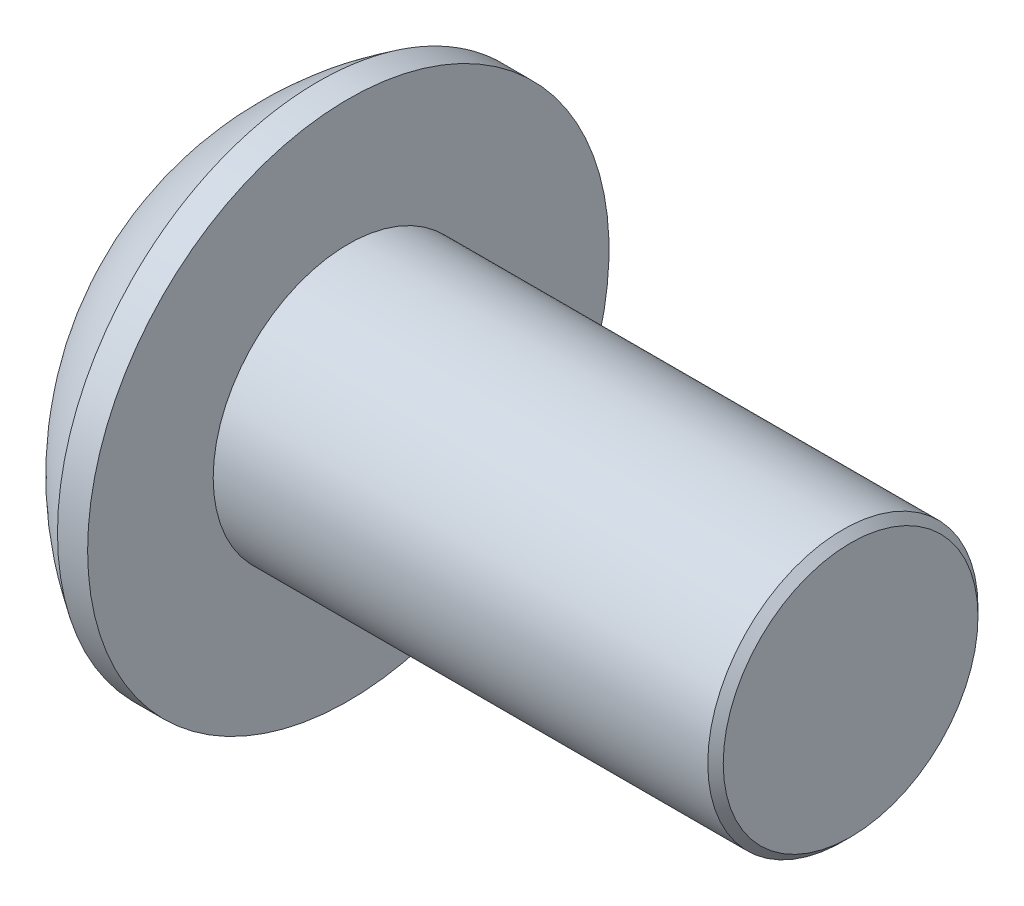
ISO-10303-21;
HEADER;
FILE_DESCRIPTION(('STEP AP214'),'2;1');
FILE_NAME('part.step','',(''),(''),'','','');
FILE_SCHEMA(('AUTOMOTIVE_DESIGN { 1 0 10303 214 1 1 1 1 }'));
ENDSEC;
DATA;
#1=APPLICATION_CONTEXT('core data for automotive mechanical design processes');
#2=APPLICATION_PROTOCOL_DEFINITION('international standard','automotive_design',2000,#1);
#3=PRODUCT_CONTEXT('',#1,'mechanical');
#4=PRODUCT('Part','Part','',(#3));
#5=PRODUCT_RELATED_PRODUCT_CATEGORY('part','',(#4));
#6=PRODUCT_DEFINITION_FORMATION('','',#4);
#7=PRODUCT_DEFINITION_CONTEXT('part definition',#1,'design');
#8=PRODUCT_DEFINITION('design','',#6,#7);
#9=PRODUCT_DEFINITION_SHAPE('','',#8);
#10=(LENGTH_UNIT() NAMED_UNIT(*) SI_UNIT(.MILLI.,.METRE.));
#11=(NAMED_UNIT(*) PLANE_ANGLE_UNIT() SI_UNIT($,.RADIAN.));
#12=(NAMED_UNIT(*) SI_UNIT($,.STERADIAN.) SOLID_ANGLE_UNIT());
#13=UNCERTAINTY_MEASURE_WITH_UNIT(LENGTH_MEASURE(1.E-05),#10,'distance_accuracy_value','');
#14=(GEOMETRIC_REPRESENTATION_CONTEXT(3) GLOBAL_UNCERTAINTY_ASSIGNED_CONTEXT((#13)) GLOBAL_UNIT_ASSIGNED_CONTEXT((#10,
#11,#12)) REPRESENTATION_CONTEXT('',''));
#15=CARTESIAN_POINT('',(0.,0.,0.));
#16=DIRECTION('',(0.,0.,1.));
#17=DIRECTION('',(1.,0.,0.));
#18=AXIS2_PLACEMENT_3D('',#15,#16,#17);
#19=CARTESIAN_POINT('',(1.32080000000034,0.,0.));
#20=DIRECTION('',(-1.,0.,0.));
#21=DIRECTION('',(0.,0.,1.));
#22=AXIS2_PLACEMENT_3D('',#19,#20,#21);
#23=CONICAL_SURFACE('',#22,1.1937999999998,1.04719755119608);
#24=CARTESIAN_POINT('',(2.01004075135902,0.,4.44089209850063E-13));
#25=VERTEX_POINT('',#24);
#26=VERTEX_LOOP('',#25);
#27=FACE_BOUND('',#26,.T.);
#28=CARTESIAN_POINT('',(1.32080000000009,0.,0.));
#29=DIRECTION('',(-1.,0.,0.));
#30=DIRECTION('',(0.,0.,1.));
#31=AXIS2_PLACEMENT_3D('',#28,#29,#30);
#32=CIRCLE('',#31,1.19380000000024);
#33=CARTESIAN_POINT('',(1.32080000000004,0.,1.19380000000012));
#34=VERTEX_POINT('',#33);
#35=CARTESIAN_POINT('',(1.32080000000004,-1.03386112703797,0.596900000000061));
#36=VERTEX_POINT('',#35);
#37=EDGE_CURVE('E20',#34,#36,#32,.F.);
#38=ORIENTED_EDGE('',*,*,#37,.F.);
#39=CARTESIAN_POINT('',(1.32080000000009,0.,0.));
#40=DIRECTION('',(-1.,0.,0.));
#41=DIRECTION('',(0.,0.,1.));
#42=AXIS2_PLACEMENT_3D('',#39,#40,#41);
#43=CIRCLE('',#42,1.19380000000024);
#44=CARTESIAN_POINT('',(1.32080000000004,1.03386112703797,0.596900000000063));
#45=VERTEX_POINT('',#44);
#46=EDGE_CURVE('E90',#45,#34,#43,.F.);
#47=ORIENTED_EDGE('',*,*,#46,.F.);
#48=CARTESIAN_POINT('',(1.32080000000009,0.,0.));
#49=DIRECTION('',(-1.,0.,0.));
#50=DIRECTION('',(0.,0.,1.));
#51=AXIS2_PLACEMENT_3D('',#48,#49,#50);
#52=CIRCLE('',#51,1.19380000000024);
#53=CARTESIAN_POINT('',(1.32080000000004,1.03386112703797,-0.596900000000063));
#54=VERTEX_POINT('',#53);
#55=EDGE_CURVE('E106',#54,#45,#52,.F.);
#56=ORIENTED_EDGE('',*,*,#55,.F.);
#57=CARTESIAN_POINT('',(1.32080000000009,0.,0.));
#58=DIRECTION('',(-1.,0.,0.));
#59=DIRECTION('',(0.,0.,1.));
#60=AXIS2_PLACEMENT_3D('',#57,#58,#59);
#61=CIRCLE('',#60,1.19380000000024);
#62=CARTESIAN_POINT('',(1.32080000000004,1.49420287879031E-12,-1.19380000000012));
#63=VERTEX_POINT('',#62);
#64=EDGE_CURVE('E444',#63,#54,#61,.F.);
#65=ORIENTED_EDGE('',*,*,#64,.F.);
#66=CARTESIAN_POINT('',(1.32080000000009,0.,0.));
#67=DIRECTION('',(-1.,0.,0.));
#68=DIRECTION('',(0.,0.,1.));
#69=AXIS2_PLACEMENT_3D('',#66,#67,#68);
#70=CIRCLE('',#69,1.19380000000024);
#71=CARTESIAN_POINT('',(1.32080000000004,-1.03386112703797,-0.596900000000062));
#72=VERTEX_POINT('',#71);
#73=EDGE_CURVE('E447',#72,#63,#70,.F.);
#74=ORIENTED_EDGE('',*,*,#73,.F.);
#75=CARTESIAN_POINT('',(1.32080000000009,0.,0.));
#76=DIRECTION('',(-1.,0.,0.));
#77=DIRECTION('',(0.,0.,1.));
#78=AXIS2_PLACEMENT_3D('',#75,#76,#77);
#79=CIRCLE('',#78,1.19380000000024);
#80=EDGE_CURVE('E93',#36,#72,#79,.F.);
#81=ORIENTED_EDGE('',*,*,#80,.F.);
#82=EDGE_LOOP('',(#38,#47,#56,#65,#74,#81));
#83=FACE_BOUND('',#82,.T.);
#84=ADVANCED_FACE('F17',(#27,#83),#23,.F.);
#85=CARTESIAN_POINT('',(1.3208,0.,2.3876));
#86=DIRECTION('',(-1.,0.,0.));
#87=DIRECTION('',(0.,0.,1.));
#88=AXIS2_PLACEMENT_3D('',#85,#86,#87);
#89=PLANE('',#88);
#90=DIRECTION('',(0.,1.,0.));
#91=VECTOR('',#90,1.);
#92=CARTESIAN_POINT('',(1.3208,-0.689240751358576,1.1938));
#93=LINE('',#92,#91);
#94=CARTESIAN_POINT('',(1.3208,-0.689240751358576,1.1938));
#95=VERTEX_POINT('',#94);
#96=EDGE_CURVE('E109',#34,#95,#93,.F.);
#97=ORIENTED_EDGE('',*,*,#96,.F.);
#98=ORIENTED_EDGE('',*,*,#37,.T.);
#99=DIRECTION('',(0.,0.5,0.866025403784439));
#100=VECTOR('',#99,1.);
#101=CARTESIAN_POINT('',(1.3208,-1.37848150271715,0.));
#102=LINE('',#101,#100);
#103=EDGE_CURVE('E112',#95,#36,#102,.F.);
#104=ORIENTED_EDGE('',*,*,#103,.F.);
#105=EDGE_LOOP('',(#97,#98,#104));
#106=FACE_BOUND('',#105,.T.);
#107=ADVANCED_FACE('F110',(#106),#89,.T.);
#108=CARTESIAN_POINT('',(1.3208,0.,2.3876));
#109=DIRECTION('',(-1.,0.,0.));
#110=DIRECTION('',(0.,0.,1.));
#111=AXIS2_PLACEMENT_3D('',#108,#109,#110);
#112=PLANE('',#111);
#113=DIRECTION('',(0.,0.5,0.866025403784439));
#114=VECTOR('',#113,1.);
#115=CARTESIAN_POINT('',(1.3208,-1.37848150271715,0.));
#116=LINE('',#115,#114);
#117=CARTESIAN_POINT('',(1.3208,-1.37848150271715,0.));
#118=VERTEX_POINT('',#117);
#119=EDGE_CURVE('E172',#36,#118,#116,.F.);
#120=ORIENTED_EDGE('',*,*,#119,.F.);
#121=ORIENTED_EDGE('',*,*,#80,.T.);
#122=DIRECTION('',(0.,-0.5,0.866025403784439));
#123=VECTOR('',#122,1.);
#124=CARTESIAN_POINT('',(1.3208,-0.689240751358576,-1.1938));
#125=LINE('',#124,#123);
#126=EDGE_CURVE('E160',#118,#72,#125,.F.);
#127=ORIENTED_EDGE('',*,*,#126,.F.);
#128=EDGE_LOOP('',(#120,#121,#127));
#129=FACE_BOUND('',#128,.T.);
#130=ADVANCED_FACE('F249',(#129),#112,.T.);
#131=CARTESIAN_POINT('',(1.3208,0.,2.3876));
#132=DIRECTION('',(-1.,0.,0.));
#133=DIRECTION('',(0.,0.,1.));
#134=AXIS2_PLACEMENT_3D('',#131,#132,#133);
#135=PLANE('',#134);
#136=DIRECTION('',(0.,-0.5,0.866025403784439));
#137=VECTOR('',#136,1.);
#138=CARTESIAN_POINT('',(1.3208,-0.689240751358576,-1.1938));
#139=LINE('',#138,#137);
#140=CARTESIAN_POINT('',(1.3208,-0.689240751358576,-1.1938));
#141=VERTEX_POINT('',#140);
#142=EDGE_CURVE('E157',#72,#141,#139,.F.);
#143=ORIENTED_EDGE('',*,*,#142,.F.);
#144=ORIENTED_EDGE('',*,*,#73,.T.);
#145=DIRECTION('',(0.,-1.,0.));
#146=VECTOR('',#145,1.);
#147=CARTESIAN_POINT('',(1.3208,0.689240751358575,-1.1938));
#148=LINE('',#147,#146);
#149=EDGE_CURVE('E144',#141,#63,#148,.F.);
#150=ORIENTED_EDGE('',*,*,#149,.F.);
#151=EDGE_LOOP('',(#143,#144,#150));
#152=FACE_BOUND('',#151,.T.);
#153=ADVANCED_FACE('F245',(#152),#135,.T.);
#154=CARTESIAN_POINT('',(1.3208,0.,2.3876));
#155=DIRECTION('',(-1.,0.,0.));
#156=DIRECTION('',(0.,0.,1.));
#157=AXIS2_PLACEMENT_3D('',#154,#155,#156);
#158=PLANE('',#157);
#159=DIRECTION('',(0.,-1.,0.));
#160=VECTOR('',#159,1.);
#161=CARTESIAN_POINT('',(1.3208,0.689240751358575,-1.1938));
#162=LINE('',#161,#160);
#163=CARTESIAN_POINT('',(1.3208,0.689240751358575,-1.1938));
#164=VERTEX_POINT('',#163);
#165=EDGE_CURVE('E141',#63,#164,#162,.F.);
#166=ORIENTED_EDGE('',*,*,#165,.F.);
#167=ORIENTED_EDGE('',*,*,#64,.T.);
#168=DIRECTION('',(0.,-0.500000000000001,-0.866025403784438));
#169=VECTOR('',#168,1.);
#170=CARTESIAN_POINT('',(1.3208,1.37848150271715,0.));
#171=LINE('',#170,#169);
#172=EDGE_CURVE('E129',#164,#54,#171,.F.);
#173=ORIENTED_EDGE('',*,*,#172,.F.);
#174=EDGE_LOOP('',(#166,#167,#173));
#175=FACE_BOUND('',#174,.T.);
#176=ADVANCED_FACE('F241',(#175),#158,.T.);
#177=CARTESIAN_POINT('',(1.3208,0.,2.3876));
#178=DIRECTION('',(-1.,0.,0.));
#179=DIRECTION('',(0.,0.,1.));
#180=AXIS2_PLACEMENT_3D('',#177,#178,#179);
#181=PLANE('',#180);
#182=DIRECTION('',(0.,-0.500000000000001,-0.866025403784438));
#183=VECTOR('',#182,1.);
#184=CARTESIAN_POINT('',(1.3208,1.37848150271715,0.));
#185=LINE('',#184,#183);
#186=CARTESIAN_POINT('',(1.3208,1.37848150271715,0.));
#187=VERTEX_POINT('',#186);
#188=EDGE_CURVE('E126',#54,#187,#185,.F.);
#189=ORIENTED_EDGE('',*,*,#188,.F.);
#190=ORIENTED_EDGE('',*,*,#55,.T.);
#191=DIRECTION('',(0.,0.500000000000001,-0.866025403784438));
#192=VECTOR('',#191,1.);
#193=CARTESIAN_POINT('',(1.3208,0.689240751358575,1.1938));
#194=LINE('',#193,#192);
#195=EDGE_CURVE('E149',#187,#45,#194,.F.);
#196=ORIENTED_EDGE('',*,*,#195,.F.);
#197=EDGE_LOOP('',(#189,#190,#196));
#198=FACE_BOUND('',#197,.T.);
#199=ADVANCED_FACE('F238',(#198),#181,.T.);
#200=CARTESIAN_POINT('',(1.3208,0.,2.3876));
#201=DIRECTION('',(-1.,0.,0.));
#202=DIRECTION('',(0.,0.,1.));
#203=AXIS2_PLACEMENT_3D('',#200,#201,#202);
#204=PLANE('',#203);
#205=DIRECTION('',(0.,0.500000000000001,-0.866025403784438));
#206=VECTOR('',#205,1.);
#207=CARTESIAN_POINT('',(1.3208,0.689240751358575,1.1938));
#208=LINE('',#207,#206);
#209=CARTESIAN_POINT('',(1.3208,0.689240751358575,1.1938));
#210=VERTEX_POINT('',#209);
#211=EDGE_CURVE('E104',#45,#210,#208,.F.);
#212=ORIENTED_EDGE('',*,*,#211,.F.);
#213=ORIENTED_EDGE('',*,*,#46,.T.);
#214=DIRECTION('',(0.,1.,0.));
#215=VECTOR('',#214,1.);
#216=CARTESIAN_POINT('',(1.3208,-0.689240751358576,1.1938));
#217=LINE('',#216,#215);
#218=EDGE_CURVE('E101',#210,#34,#217,.F.);
#219=ORIENTED_EDGE('',*,*,#218,.F.);
#220=EDGE_LOOP('',(#212,#213,#219));
#221=FACE_BOUND('',#220,.T.);
#222=ADVANCED_FACE('F99',(#221),#204,.T.);
#223=CARTESIAN_POINT('',(1.3208,-0.689240751358576,1.1938));
#224=DIRECTION('',(0.,0.,-1.));
#225=DIRECTION('',(0.,1.,0.));
#226=AXIS2_PLACEMENT_3D('',#223,#224,#225);
#227=PLANE('',#226);
#228=DIRECTION('',(0.,1.,0.));
#229=VECTOR('',#228,1.);
#230=CARTESIAN_POINT('',(0.,0.,1.1938));
#231=LINE('',#230,#229);
#232=CARTESIAN_POINT('',(0.,0.689240751358575,1.1938));
#233=VERTEX_POINT('',#232);
#234=CARTESIAN_POINT('',(0.,-0.689240751358576,1.1938));
#235=VERTEX_POINT('',#234);
#236=EDGE_CURVE('E133',#233,#235,#231,.F.);
#237=ORIENTED_EDGE('',*,*,#236,.F.);
#238=DIRECTION('',(1.,0.,0.));
#239=VECTOR('',#238,1.);
#240=CARTESIAN_POINT('',(1.3208,0.689240751358575,1.1938));
#241=LINE('',#240,#239);
#242=EDGE_CURVE('E118',#210,#233,#241,.F.);
#243=ORIENTED_EDGE('',*,*,#242,.F.);
#244=ORIENTED_EDGE('',*,*,#218,.T.);
#245=ORIENTED_EDGE('',*,*,#96,.T.);
#246=DIRECTION('',(1.,0.,0.));
#247=VECTOR('',#246,1.);
#248=CARTESIAN_POINT('',(1.3208,-0.689240751358576,1.1938));
#249=LINE('',#248,#247);
#250=EDGE_CURVE('E169',#235,#95,#249,.T.);
#251=ORIENTED_EDGE('',*,*,#250,.F.);
#252=EDGE_LOOP('',(#237,#243,#244,#245,#251));
#253=FACE_BOUND('',#252,.T.);
#254=ADVANCED_FACE('F116',(#253),#227,.T.);
#255=CARTESIAN_POINT('',(1.3208,-1.37848150271715,0.));
#256=DIRECTION('',(0.,0.866025403784439,-0.5));
#257=DIRECTION('',(0.,0.5,0.866025403784439));
#258=AXIS2_PLACEMENT_3D('',#255,#256,#257);
#259=PLANE('',#258);
#260=DIRECTION('',(0.,-0.5,-0.866025403784439));
#261=VECTOR('',#260,1.);
#262=CARTESIAN_POINT('',(0.,-0.689240751358576,1.1938));
#263=LINE('',#262,#261);
#264=CARTESIAN_POINT('',(0.,-1.37848150271715,0.));
#265=VERTEX_POINT('',#264);
#266=EDGE_CURVE('E431',#235,#265,#263,.T.);
#267=ORIENTED_EDGE('',*,*,#266,.F.);
#268=ORIENTED_EDGE('',*,*,#250,.T.);
#269=ORIENTED_EDGE('',*,*,#103,.T.);
#270=ORIENTED_EDGE('',*,*,#119,.T.);
#271=DIRECTION('',(1.,0.,0.));
#272=VECTOR('',#271,1.);
#273=CARTESIAN_POINT('',(1.3208,-1.37848150271715,0.));
#274=LINE('',#273,#272);
#275=EDGE_CURVE('E154',#265,#118,#274,.T.);
#276=ORIENTED_EDGE('',*,*,#275,.F.);
#277=EDGE_LOOP('',(#267,#268,#269,#270,#276));
#278=FACE_BOUND('',#277,.T.);
#279=ADVANCED_FACE('F229',(#278),#259,.T.);
#280=CARTESIAN_POINT('',(1.3208,-0.689240751358576,-1.1938));
#281=DIRECTION('',(0.,0.866025403784439,0.5));
#282=DIRECTION('',(0.,-0.5,0.866025403784439));
#283=AXIS2_PLACEMENT_3D('',#280,#281,#282);
#284=PLANE('',#283);
#285=DIRECTION('',(0.,0.5,-0.866025403784439));
#286=VECTOR('',#285,1.);
#287=CARTESIAN_POINT('',(0.,-1.37848150271715,0.));
#288=LINE('',#287,#286);
#289=CARTESIAN_POINT('',(0.,-0.689240751358576,-1.1938));
#290=VERTEX_POINT('',#289);
#291=EDGE_CURVE('E428',#265,#290,#288,.T.);
#292=ORIENTED_EDGE('',*,*,#291,.F.);
#293=ORIENTED_EDGE('',*,*,#275,.T.);
#294=ORIENTED_EDGE('',*,*,#126,.T.);
#295=ORIENTED_EDGE('',*,*,#142,.T.);
#296=DIRECTION('',(1.,0.,0.));
#297=VECTOR('',#296,1.);
#298=CARTESIAN_POINT('',(1.3208,-0.689240751358576,-1.1938));
#299=LINE('',#298,#297);
#300=EDGE_CURVE('E138',#290,#141,#299,.T.);
#301=ORIENTED_EDGE('',*,*,#300,.F.);
#302=EDGE_LOOP('',(#292,#293,#294,#295,#301));
#303=FACE_BOUND('',#302,.T.);
#304=ADVANCED_FACE('F225',(#303),#284,.T.);
#305=CARTESIAN_POINT('',(1.3208,0.689240751358575,-1.1938));
#306=DIRECTION('',(0.,0.,1.));
#307=DIRECTION('',(0.,-1.,0.));
#308=AXIS2_PLACEMENT_3D('',#305,#306,#307);
#309=PLANE('',#308);
#310=DIRECTION('',(0.,1.,0.));
#311=VECTOR('',#310,1.);
#312=CARTESIAN_POINT('',(0.,0.,-1.1938));
#313=LINE('',#312,#311);
#314=CARTESIAN_POINT('',(0.,0.689240751358575,-1.1938));
#315=VERTEX_POINT('',#314);
#316=EDGE_CURVE('E425',#290,#315,#313,.T.);
#317=ORIENTED_EDGE('',*,*,#316,.F.);
#318=ORIENTED_EDGE('',*,*,#300,.T.);
#319=ORIENTED_EDGE('',*,*,#149,.T.);
#320=ORIENTED_EDGE('',*,*,#165,.T.);
#321=DIRECTION('',(1.,0.,0.));
#322=VECTOR('',#321,1.);
#323=CARTESIAN_POINT('',(1.3208,0.689240751358575,-1.1938));
#324=LINE('',#323,#322);
#325=EDGE_CURVE('E128',#315,#164,#324,.T.);
#326=ORIENTED_EDGE('',*,*,#325,.F.);
#327=EDGE_LOOP('',(#317,#318,#319,#320,#326));
#328=FACE_BOUND('',#327,.T.);
#329=ADVANCED_FACE('F222',(#328),#309,.T.);
#330=CARTESIAN_POINT('',(1.3208,1.37848150271715,0.));
#331=DIRECTION('',(0.,-0.866025403784438,0.500000000000001));
#332=DIRECTION('',(0.,-0.500000000000001,-0.866025403784438));
#333=AXIS2_PLACEMENT_3D('',#330,#331,#332);
#334=PLANE('',#333);
#335=DIRECTION('',(0.,0.500000000000001,0.866025403784438));
#336=VECTOR('',#335,1.);
#337=CARTESIAN_POINT('',(0.,0.689240751358575,-1.1938));
#338=LINE('',#337,#336);
#339=CARTESIAN_POINT('',(0.,1.37848150271715,0.));
#340=VERTEX_POINT('',#339);
#341=EDGE_CURVE('E422',#315,#340,#338,.T.);
#342=ORIENTED_EDGE('',*,*,#341,.F.);
#343=ORIENTED_EDGE('',*,*,#325,.T.);
#344=ORIENTED_EDGE('',*,*,#172,.T.);
#345=ORIENTED_EDGE('',*,*,#188,.T.);
#346=DIRECTION('',(1.,0.,0.));
#347=VECTOR('',#346,1.);
#348=CARTESIAN_POINT('',(1.3208,1.37848150271715,0.));
#349=LINE('',#348,#347);
#350=EDGE_CURVE('E35',#340,#187,#349,.T.);
#351=ORIENTED_EDGE('',*,*,#350,.F.);
#352=EDGE_LOOP('',(#342,#343,#344,#345,#351));
#353=FACE_BOUND('',#352,.T.);
#354=ADVANCED_FACE('F218',(#353),#334,.T.);
#355=CARTESIAN_POINT('',(1.3208,0.689240751358575,1.1938));
#356=DIRECTION('',(0.,-0.866025403784438,-0.500000000000001));
#357=DIRECTION('',(0.,0.500000000000001,-0.866025403784438));
#358=AXIS2_PLACEMENT_3D('',#355,#356,#357);
#359=PLANE('',#358);
#360=DIRECTION('',(0.,-0.500000000000001,0.866025403784438));
#361=VECTOR('',#360,1.);
#362=CARTESIAN_POINT('',(0.,1.37848150271715,0.));
#363=LINE('',#362,#361);
#364=EDGE_CURVE('E204',#340,#233,#363,.T.);
#365=ORIENTED_EDGE('',*,*,#364,.F.);
#366=ORIENTED_EDGE('',*,*,#350,.T.);
#367=ORIENTED_EDGE('',*,*,#195,.T.);
#368=ORIENTED_EDGE('',*,*,#211,.T.);
#369=ORIENTED_EDGE('',*,*,#242,.T.);
#370=EDGE_LOOP('',(#365,#366,#367,#368,#369));
#371=FACE_BOUND('',#370,.T.);
#372=ADVANCED_FACE('F214',(#371),#359,.T.);
#373=CARTESIAN_POINT('',(0.,0.,0.));
#374=DIRECTION('',(-1.,0.,0.));
#375=DIRECTION('',(0.,0.,1.));
#376=AXIS2_PLACEMENT_3D('',#373,#374,#375);
#377=PLANE('',#376);
#378=ORIENTED_EDGE('',*,*,#341,.T.);
#379=ORIENTED_EDGE('',*,*,#364,.T.);
#380=ORIENTED_EDGE('',*,*,#236,.T.);
#381=ORIENTED_EDGE('',*,*,#266,.T.);
#382=ORIENTED_EDGE('',*,*,#291,.T.);
#383=ORIENTED_EDGE('',*,*,#316,.T.);
#384=EDGE_LOOP('',(#378,#379,#380,#381,#382,#383));
#385=FACE_BOUND('',#384,.T.);
#386=CARTESIAN_POINT('',(0.,1.647825,0.));
#387=CARTESIAN_POINT('',(1.6308873576372E-13,1.64781976319874,0.0924902039777533));
#388=CARTESIAN_POINT('',(1.32723456051501E-13,1.63999511633709,0.185145014326371));
#389=CARTESIAN_POINT('',(0.,1.6167119250047,0.322075808080014));
#390=CARTESIAN_POINT('',(-1.58307829769064E-13,1.60700618770234,0.367435533396361));
#391=CARTESIAN_POINT('',(1.5887042259766E-13,1.58380101865853,0.457220935695141));
#392=CARTESIAN_POINT('',(5.68553662672778E-13,1.5702985083103,0.501645823115265));
#393=CARTESIAN_POINT('',(9.36169533411239E-13,1.52428156574313,0.632817459278969));
#394=CARTESIAN_POINT('',(0.,1.48621992666366,0.717681965518645));
#395=CARTESIAN_POINT('',(0.,1.39637079695658,0.879809706624018));
#396=CARTESIAN_POINT('',(7.82226199304679E-13,1.34458278455109,0.957072652379997));
#397=CARTESIAN_POINT('',(4.86961747456247E-13,1.25777784714521,1.06558770210238));
#398=CARTESIAN_POINT('',(1.3347006403413E-13,1.22729946114794,1.10054993332365));
#399=CARTESIAN_POINT('',(-1.32907906987598E-13,1.16354004969106,1.16775237388222));
#400=CARTESIAN_POINT('',(0.,1.13026175473033,1.19999517515816));
#401=CARTESIAN_POINT('',(0.,1.02649304340867,1.29236218866442));
#402=CARTESIAN_POINT('',(0.,0.952049986714078,1.34814848277713));
#403=CARTESIAN_POINT('',(0.,0.794895196754069,1.44639825105766));
#404=CARTESIAN_POINT('',(0.,0.712183775431296,1.48886222758992));
#405=CARTESIAN_POINT('',(0.,0.540796624265729,1.55930919813143));
#406=CARTESIAN_POINT('',(0.,0.452120958135285,1.58729234680269));
#407=CARTESIAN_POINT('',(0.,0.271332331080316,1.62797191307414));
#408=CARTESIAN_POINT('',(0.,0.179219351801787,1.64066824903626));
#409=CARTESIAN_POINT('',(0.,-0.00583077027841068,1.65041748705409));
#410=CARTESIAN_POINT('',(0.,-0.0987679130800802,1.64747038910979));
#411=CARTESIAN_POINT('',(0.,-0.282830196388828,1.62601274134436));
#412=CARTESIAN_POINT('',(0.,-0.373955346570022,1.60750227463795));
#413=CARTESIAN_POINT('',(0.,-0.551796068178808,1.55545413364524));
#414=CARTESIAN_POINT('',(0.,-0.63851159249817,1.52191629885844));
#415=CARTESIAN_POINT('',(0.,-0.805120175533158,1.44072378052347));
#416=CARTESIAN_POINT('',(0.,-0.88501297681996,1.39306856461394));
#417=CARTESIAN_POINT('',(0.,-0.997912879588364,1.31211658756413));
#418=CARTESIAN_POINT('',(0.,-1.0343949246834,1.28354906167735));
#419=CARTESIAN_POINT('',(0.,-1.10486279842069,1.2234182930371));
#420=CARTESIAN_POINT('',(0.,-1.13884618403291,1.19185218578118));
#421=CARTESIAN_POINT('',(0.,-1.23657300939909,1.09305906467359));
#422=CARTESIAN_POINT('',(0.,-1.29619288399357,1.02166556658613));
#423=CARTESIAN_POINT('',(0.,-1.40258050817756,0.869876423478037));
#424=CARTESIAN_POINT('',(0.,-1.44934874627767,0.789481120793482));
#425=CARTESIAN_POINT('',(0.,-1.50889406070376,0.663870959313345));
#426=CARTESIAN_POINT('',(0.,-1.52698985473587,0.621110806760431));
#427=CARTESIAN_POINT('',(0.,-1.55950093966665,0.534260776864335));
#428=CARTESIAN_POINT('',(-1.05039697618021E-13,-1.57391920916439,0.490172008203172));
#429=CARTESIAN_POINT('',(2.10178020665955E-13,-1.6114617790958,0.356445777718599));
#430=CARTESIAN_POINT('',(1.14251859340662E-12,-1.62897899568075,0.265126085962908));
#431=CARTESIAN_POINT('',(4.34048914238184E-13,-1.6417434721491,0.144386595969389));
#432=CARTESIAN_POINT('',(1.2133871111091E-13,-1.64402207668917,0.115560405797876));
#433=CARTESIAN_POINT('',(-1.2090503024199E-13,-1.64706365940122,0.0578281757252701));
#434=CARTESIAN_POINT('',(0.,-1.64782663757319,0.0289221358241782));
#435=CARTESIAN_POINT('',(1.64938783669285E-13,-1.64781976319875,-0.0924902039777538));
#436=CARTESIAN_POINT('',(1.33063346980503E-13,-1.63999511633711,-0.18514501432637));
#437=CARTESIAN_POINT('',(0.,-1.61671192500471,-0.322075808080014));
#438=CARTESIAN_POINT('',(-1.58354507530811E-13,-1.60700618770236,-0.367435533396362));
#439=CARTESIAN_POINT('',(1.58917138317674E-13,-1.58380101865854,-0.457220935695141));
#440=CARTESIAN_POINT('',(5.68569932116631E-13,-1.57029850831032,-0.501645823115264));
#441=CARTESIAN_POINT('',(9.36137072078051E-13,-1.52428156574314,-0.632817459278968));
#442=CARTESIAN_POINT('',(0.,-1.48621992666367,-0.717681965518645));
#443=CARTESIAN_POINT('',(0.,-1.3963707969566,-0.879809706624018));
#444=CARTESIAN_POINT('',(7.8222767876737E-13,-1.34458278455111,-0.957072652379997));
#445=CARTESIAN_POINT('',(4.86961006755577E-13,-1.25777784714523,-1.06558770210238));
#446=CARTESIAN_POINT('',(1.33469967938541E-13,-1.22729946114795,-1.10054993332365));
#447=CARTESIAN_POINT('',(-1.32907810984659E-13,-1.16354004969108,-1.16775237388222));
#448=CARTESIAN_POINT('',(0.,-1.13026175473034,-1.19999517515816));
#449=CARTESIAN_POINT('',(0.,-1.02649304340868,-1.29236218866442));
#450=CARTESIAN_POINT('',(0.,-0.952049986714093,-1.34814848277713));
#451=CARTESIAN_POINT('',(0.,-0.794895196754083,-1.44639825105766));
#452=CARTESIAN_POINT('',(0.,-0.71218377543131,-1.48886222758992));
#453=CARTESIAN_POINT('',(0.,-0.540796624265743,-1.55930919813143));
#454=CARTESIAN_POINT('',(0.,-0.452120958135299,-1.58729234680269));
#455=CARTESIAN_POINT('',(0.,-0.27133233108033,-1.62797191307414));
#456=CARTESIAN_POINT('',(0.,-0.179219351801801,-1.64066824903626));
#457=CARTESIAN_POINT('',(0.,0.00583077027839649,-1.65041748705409));
#458=CARTESIAN_POINT('',(0.,0.0987679130800661,-1.64747038910979));
#459=CARTESIAN_POINT('',(0.,0.282830196388813,-1.62601274134436));
#460=CARTESIAN_POINT('',(0.,0.373955346570007,-1.60750227463795));
#461=CARTESIAN_POINT('',(0.,0.551796068178793,-1.55545413364524));
#462=CARTESIAN_POINT('',(0.,0.638511592498156,-1.52191629885844));
#463=CARTESIAN_POINT('',(0.,0.805120175533144,-1.44072378052347));
#464=CARTESIAN_POINT('',(0.,0.885012976819946,-1.39306856461394));
#465=CARTESIAN_POINT('',(0.,0.99791287958835,-1.31211658756413));
#466=CARTESIAN_POINT('',(0.,1.03439492468339,-1.28354906167735));
#467=CARTESIAN_POINT('',(0.,1.10486279842068,-1.2234182930371));
#468=CARTESIAN_POINT('',(0.,1.1388461840329,-1.19185218578118));
#469=CARTESIAN_POINT('',(0.,1.23657300939908,-1.09305906467359));
#470=CARTESIAN_POINT('',(0.,1.29619288399356,-1.02166556658613));
#471=CARTESIAN_POINT('',(0.,1.40258050817755,-0.869876423478036));
#472=CARTESIAN_POINT('',(0.,1.44934874627766,-0.789481120793482));
#473=CARTESIAN_POINT('',(0.,1.50889406070375,-0.663870959313345));
#474=CARTESIAN_POINT('',(0.,1.52698985473586,-0.621110806760431));
#475=CARTESIAN_POINT('',(0.,1.55950093966663,-0.534260776864334));
#476=CARTESIAN_POINT('',(-1.04953536136957E-13,1.57391920916437,-0.490172008203171));
#477=CARTESIAN_POINT('',(2.10006149477814E-13,1.61146177909579,-0.356445777718599));
#478=CARTESIAN_POINT('',(1.14225956750636E-12,1.62897899568074,-0.265126085962908));
#479=CARTESIAN_POINT('',(4.34129912894769E-13,1.64174347214908,-0.144386595969389));
#480=CARTESIAN_POINT('',(1.21534559462057E-13,1.64402207668915,-0.115560405797875));
#481=CARTESIAN_POINT('',(-1.21100878593138E-13,1.6470636594012,-0.0578281757252705));
#482=CARTESIAN_POINT('',(0.,1.64782663757318,-0.0289221358241788));
#483=CARTESIAN_POINT('',(0.,1.647825,0.));
#484=B_SPLINE_CURVE_WITH_KNOTS('',3,(#386,#387,#388,#389,#390,#391,#392,#393,#394,#395,#396,
#397,#398,#399,#400,#401,#402,#403,#404,#405,#406,#407,#408,#409,#410,#411,#412,#413,#414,#415,
#416,#417,#418,#419,#420,#421,#422,#423,#424,#425,#426,#427,#428,#429,#430,#431,#432,#433,#434,
#435,#436,#437,#438,#439,#440,#441,#442,#443,#444,#445,#446,#447,#448,#449,#450,#451,#452,#453,
#454,#455,#456,#457,#458,#459,#460,#461,#462,#463,#464,#465,#466,#467,#468,#469,#470,#471,#472,
#473,#474,#475,#476,#477,#478,#479,#480,#481,#482,#483),.UNSPECIFIED.,.T.,.F.,(4,2,2,2,2,2,2,2,
2,2,2,2,2,2,2,2,2,2,2,2,2,2,2,2,2,2,2,2,2,2,2,2,2,2,2,2,2,2,2,2,2,2,2,2,2,2,2,2,4),(0.,
0.277336029422427,0.416368541537112,0.555514114625601,0.833141970294989,1.11078038089036,
1.24978149120748,1.38864858351854,1.66629367015056,1.94392828594775,2.22155993641642,
2.49919306954938,2.77682620268235,3.05445785315102,3.33209246894821,3.60973755557991,
3.74860464789075,3.88760575820768,4.16524416880334,4.44287202447289,4.58201759756162,
4.72105010967663,4.99838613909884,5.08511046196679,5.17183478483479,5.44917081425721,
5.5882033263719,5.72734889946039,6.00497675512977,6.28261516572515,6.42161627604227,
6.56048336835333,6.83812845498535,7.11576307078254,7.39339472125121,7.67102785438416,
7.94866098751713,8.22629263798581,8.503927253783,8.7815723404147,8.92043943272554,
9.05944054304247,9.33707895363812,9.61470680930768,9.75385238239641,9.89288489451142,
10.1702209239336,10.2569452468016,10.3436695696696),.UNSPECIFIED.);
#485=CARTESIAN_POINT('',(0.,1.647825,0.));
#486=VERTEX_POINT('',#485);
#487=EDGE_CURVE('E198',#486,#486,#484,.T.);
#488=ORIENTED_EDGE('',*,*,#487,.F.);
#489=EDGE_LOOP('',(#488));
#490=FACE_BOUND('',#489,.T.);
#491=ADVANCED_FACE('F210',(#385,#490),#377,.T.);
#492=CARTESIAN_POINT('',(3.5013236260776,0.,0.));
#493=DIRECTION('',(0.,1.,0.));
#494=DIRECTION('',(1.,0.,0.));
#495=AXIS2_PLACEMENT_3D('',#492,#493,#494);
#496=SPHERICAL_SURFACE('',#495,3.86970210289554);
#497=CARTESIAN_POINT('',(1.4732,0.,0.));
#498=DIRECTION('',(-1.,0.,0.));
#499=DIRECTION('',(0.,0.,1.));
#500=AXIS2_PLACEMENT_3D('',#497,#498,#499);
#501=CIRCLE('',#500,3.29565);
#502=CARTESIAN_POINT('',(1.4732,0.,3.29565));
#503=VERTEX_POINT('',#502);
#504=EDGE_CURVE('E195',#503,#503,#501,.F.);
#505=ORIENTED_EDGE('',*,*,#504,.F.);
#506=EDGE_LOOP('',(#505));
#507=FACE_BOUND('',#506,.T.);
#508=ORIENTED_EDGE('',*,*,#487,.T.);
#509=EDGE_LOOP('',(#508));
#510=FACE_BOUND('',#509,.T.);
#511=ADVANCED_FACE('F206',(#507,#510),#496,.T.);
#512=CARTESIAN_POINT('',(8.2042,0.,0.));
#513=DIRECTION('',(-1.,0.,0.));
#514=DIRECTION('',(0.,0.,1.));
#515=AXIS2_PLACEMENT_3D('',#512,#513,#514);
#516=PLANE('',#515);
#517=CARTESIAN_POINT('',(8.20419999996602,0.,0.));
#518=DIRECTION('',(-1.,0.,0.));
#519=DIRECTION('',(0.,0.,1.));
#520=AXIS2_PLACEMENT_3D('',#517,#518,#519);
#521=CIRCLE('',#520,1.61035999997239);
#522=CARTESIAN_POINT('',(8.20419999996602,0.,1.61035999997239));
#523=VERTEX_POINT('',#522);
#524=EDGE_CURVE('E192',#523,#523,#521,.T.);
#525=ORIENTED_EDGE('',*,*,#524,.F.);
#526=EDGE_LOOP('',(#525));
#527=FACE_BOUND('',#526,.T.);
#528=ADVANCED_FACE('F277',(#527),#516,.F.);
#529=CARTESIAN_POINT('',(0.,0.,0.));
#530=DIRECTION('',(-1.,0.,0.));
#531=DIRECTION('',(0.,0.,1.));
#532=AXIS2_PLACEMENT_3D('',#529,#530,#531);
#533=CYLINDRICAL_SURFACE('',#532,3.29565);
#534=ORIENTED_EDGE('',*,*,#504,.T.);
#535=EDGE_LOOP('',(#534));
#536=FACE_BOUND('',#535,.T.);
#537=CARTESIAN_POINT('',(1.8542,0.,0.));
#538=DIRECTION('',(-1.,0.,0.));
#539=DIRECTION('',(0.,0.,1.));
#540=AXIS2_PLACEMENT_3D('',#537,#538,#539);
#541=CIRCLE('',#540,3.29565);
#542=CARTESIAN_POINT('',(1.8542,0.,3.29565));
#543=VERTEX_POINT('',#542);
#544=EDGE_CURVE('E189',#543,#543,#541,.T.);
#545=ORIENTED_EDGE('',*,*,#544,.T.);
#546=EDGE_LOOP('',(#545));
#547=FACE_BOUND('',#546,.T.);
#548=ADVANCED_FACE('F274',(#536,#547),#533,.T.);
#549=CARTESIAN_POINT('',(8.10641000009582,0.,0.));
#550=DIRECTION('',(-1.,0.,0.));
#551=DIRECTION('',(0.,0.,1.));
#552=AXIS2_PLACEMENT_3D('',#549,#550,#551);
#553=CONICAL_SURFACE('',#552,1.70814999989943,0.785398163688089);
#554=CARTESIAN_POINT('',(8.10641000000003,0.,0.));
#555=DIRECTION('',(-1.,0.,0.));
#556=DIRECTION('',(0.,0.,1.));
#557=AXIS2_PLACEMENT_3D('',#554,#555,#556);
#558=CIRCLE('',#557,1.70814999999999);
#559=CARTESIAN_POINT('',(8.10641000000003,0.,1.70814999999999));
#560=VERTEX_POINT('',#559);
#561=EDGE_CURVE('E26',#560,#560,#558,.T.);
#562=ORIENTED_EDGE('',*,*,#561,.F.);
#563=EDGE_LOOP('',(#562));
#564=FACE_BOUND('',#563,.T.);
#565=ORIENTED_EDGE('',*,*,#524,.T.);
#566=EDGE_LOOP('',(#565));
#567=FACE_BOUND('',#566,.T.);
#568=ADVANCED_FACE('F267',(#564,#567),#553,.T.);
#569=CARTESIAN_POINT('',(1.8542,1.70814999999999,0.));
#570=DIRECTION('',(-1.,0.,0.));
#571=DIRECTION('',(0.,0.,1.));
#572=AXIS2_PLACEMENT_3D('',#569,#570,#571);
#573=PLANE('',#572);
#574=CARTESIAN_POINT('',(1.8542,0.,0.));
#575=DIRECTION('',(-1.,0.,0.));
#576=DIRECTION('',(0.,0.,1.));
#577=AXIS2_PLACEMENT_3D('',#574,#575,#576);
#578=CIRCLE('',#577,1.70814999999999);
#579=CARTESIAN_POINT('',(1.8542,0.,1.70814999999999));
#580=VERTEX_POINT('',#579);
#581=EDGE_CURVE('E11',#580,#580,#578,.F.);
#582=ORIENTED_EDGE('',*,*,#581,.F.);
#583=EDGE_LOOP('',(#582));
#584=FACE_BOUND('',#583,.T.);
#585=ORIENTED_EDGE('',*,*,#544,.F.);
#586=EDGE_LOOP('',(#585));
#587=FACE_BOUND('',#586,.T.);
#588=ADVANCED_FACE('F261',(#584,#587),#573,.F.);
#589=CARTESIAN_POINT('',(0.,0.,0.));
#590=DIRECTION('',(-1.,0.,0.));
#591=DIRECTION('',(0.,0.,1.));
#592=AXIS2_PLACEMENT_3D('',#589,#590,#591);
#593=CYLINDRICAL_SURFACE('',#592,1.70814999999999);
#594=ORIENTED_EDGE('',*,*,#581,.T.);
#595=EDGE_LOOP('',(#594));
#596=FACE_BOUND('',#595,.T.);
#597=ORIENTED_EDGE('',*,*,#561,.T.);
#598=EDGE_LOOP('',(#597));
#599=FACE_BOUND('',#598,.T.);
#600=ADVANCED_FACE('F259',(#596,#599),#593,.T.);
#601=CLOSED_SHELL('',(#84,#107,#130,#153,#176,#199,#222,#254,#279,#304,#329,#354,#372,#491,#511,
#528,#548,#568,#588,#600));
#602=MANIFOLD_SOLID_BREP('B1',#601);
#603=ADVANCED_BREP_SHAPE_REPRESENTATION('',(#18,#602),#14);
#604=SHAPE_DEFINITION_REPRESENTATION(#9,#603);
ENDSEC;
END-ISO-10303-21;
